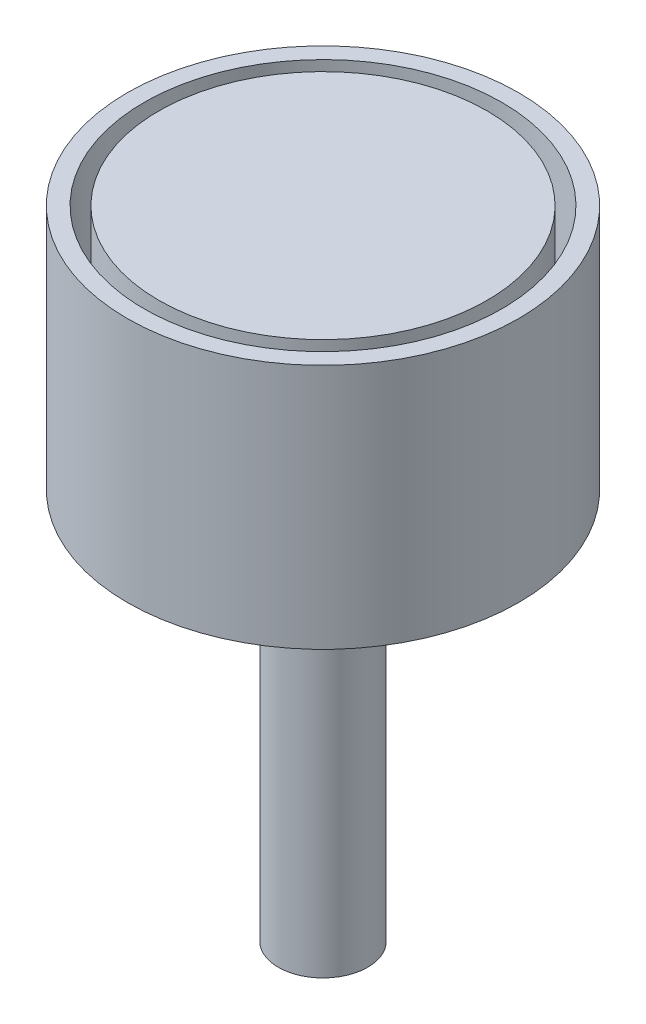
ISO-10303-21;
HEADER;
FILE_DESCRIPTION(('STEP AP214'),'2;1');
FILE_NAME('part.step','',(''),(''),'','','');
FILE_SCHEMA(('AUTOMOTIVE_DESIGN { 1 0 10303 214 1 1 1 1 }'));
ENDSEC;
DATA;
#1=APPLICATION_CONTEXT('core data for automotive mechanical design processes');
#2=APPLICATION_PROTOCOL_DEFINITION('international standard','automotive_design',2000,#1);
#3=PRODUCT_CONTEXT('',#1,'mechanical');
#4=PRODUCT('Part','Part','',(#3));
#5=PRODUCT_RELATED_PRODUCT_CATEGORY('part','',(#4));
#6=PRODUCT_DEFINITION_FORMATION('','',#4);
#7=PRODUCT_DEFINITION_CONTEXT('part definition',#1,'design');
#8=PRODUCT_DEFINITION('design','',#6,#7);
#9=PRODUCT_DEFINITION_SHAPE('','',#8);
#10=(LENGTH_UNIT() NAMED_UNIT(*) SI_UNIT(.MILLI.,.METRE.));
#11=(NAMED_UNIT(*) PLANE_ANGLE_UNIT() SI_UNIT($,.RADIAN.));
#12=(NAMED_UNIT(*) SI_UNIT($,.STERADIAN.) SOLID_ANGLE_UNIT());
#13=UNCERTAINTY_MEASURE_WITH_UNIT(LENGTH_MEASURE(1.E-05),#10,'distance_accuracy_value','');
#14=(GEOMETRIC_REPRESENTATION_CONTEXT(3) GLOBAL_UNCERTAINTY_ASSIGNED_CONTEXT((#13)) GLOBAL_UNIT_ASSIGNED_CONTEXT((#10,
#11,#12)) REPRESENTATION_CONTEXT('',''));
#15=CARTESIAN_POINT('',(0.,0.,0.));
#16=DIRECTION('',(0.,0.,1.));
#17=DIRECTION('',(1.,0.,0.));
#18=AXIS2_PLACEMENT_3D('',#15,#16,#17);
#19=CARTESIAN_POINT('',(0.,0.,0.));
#20=DIRECTION('',(0.,-1.,0.));
#21=DIRECTION('',(0.,0.,-1.));
#22=AXIS2_PLACEMENT_3D('',#19,#20,#21);
#23=PLANE('',#22);
#24=CARTESIAN_POINT('',(0.,0.,0.));
#25=DIRECTION('',(0.,1.,0.));
#26=DIRECTION('',(0.,0.,1.));
#27=AXIS2_PLACEMENT_3D('',#24,#25,#26);
#28=CIRCLE('',#27,14.68);
#29=CARTESIAN_POINT('',(0.,0.,14.68));
#30=VERTEX_POINT('',#29);
#31=EDGE_CURVE('E10',#30,#30,#28,.T.);
#32=ORIENTED_EDGE('',*,*,#31,.T.);
#33=EDGE_LOOP('',(#32));
#34=FACE_BOUND('',#33,.T.);
#35=ADVANCED_FACE('F16',(#34),#23,.F.);
#36=CARTESIAN_POINT('',(0.,-20.002,0.));
#37=DIRECTION('',(0.,1.,0.));
#38=DIRECTION('',(0.,0.,1.));
#39=AXIS2_PLACEMENT_3D('',#36,#37,#38);
#40=CYLINDRICAL_SURFACE('',#39,14.68);
#41=CARTESIAN_POINT('',(0.,-20.,0.));
#42=DIRECTION('',(0.,1.,0.));
#43=DIRECTION('',(0.,0.,-1.));
#44=AXIS2_PLACEMENT_3D('',#41,#42,#43);
#45=CIRCLE('',#44,14.68);
#46=CARTESIAN_POINT('',(0.,-20.,-14.68));
#47=VERTEX_POINT('',#46);
#48=EDGE_CURVE('E94',#47,#47,#45,.T.);
#49=ORIENTED_EDGE('',*,*,#48,.T.);
#50=EDGE_LOOP('',(#49));
#51=FACE_BOUND('',#50,.T.);
#52=ORIENTED_EDGE('',*,*,#31,.F.);
#53=EDGE_LOOP('',(#52));
#54=FACE_BOUND('',#53,.T.);
#55=ADVANCED_FACE('F18',(#51,#54),#40,.T.);
#56=CARTESIAN_POINT('',(0.,-29.1,0.));
#57=DIRECTION('',(0.,-1.,0.));
#58=DIRECTION('',(0.,0.,-1.));
#59=AXIS2_PLACEMENT_3D('',#56,#57,#58);
#60=TOROIDAL_SURFACE('',#59,6.,2.);
#61=CARTESIAN_POINT('',(0.,-29.1,0.));
#62=DIRECTION('',(0.,-1.,0.));
#63=DIRECTION('',(0.,0.,-1.));
#64=AXIS2_PLACEMENT_3D('',#61,#62,#63);
#65=CIRCLE('',#64,4.);
#66=CARTESIAN_POINT('',(0.,-29.1,-4.));
#67=VERTEX_POINT('',#66);
#68=EDGE_CURVE('E98',#67,#67,#65,.T.);
#69=ORIENTED_EDGE('',*,*,#68,.F.);
#70=EDGE_LOOP('',(#69));
#71=FACE_BOUND('',#70,.T.);
#72=CARTESIAN_POINT('',(0.,-27.3679491924311,0.));
#73=DIRECTION('',(0.,1.,0.));
#74=DIRECTION('',(0.,0.,-1.));
#75=AXIS2_PLACEMENT_3D('',#72,#73,#74);
#76=CIRCLE('',#75,5.);
#77=CARTESIAN_POINT('',(0.,-27.3679491924311,-5.));
#78=VERTEX_POINT('',#77);
#79=EDGE_CURVE('E104',#78,#78,#76,.T.);
#80=ORIENTED_EDGE('',*,*,#79,.F.);
#81=EDGE_LOOP('',(#80));
#82=FACE_BOUND('',#81,.T.);
#83=ADVANCED_FACE('F116',(#71,#82),#60,.F.);
#84=CARTESIAN_POINT('',(0.,-57.,0.));
#85=DIRECTION('',(0.,-1.,0.));
#86=DIRECTION('',(0.,0.,-1.));
#87=AXIS2_PLACEMENT_3D('',#84,#85,#86);
#88=PLANE('',#87);
#89=CARTESIAN_POINT('',(0.,-57.,0.));
#90=DIRECTION('',(0.,-1.,0.));
#91=DIRECTION('',(0.,0.,-1.));
#92=AXIS2_PLACEMENT_3D('',#89,#90,#91);
#93=CIRCLE('',#92,4.);
#94=CARTESIAN_POINT('',(0.,-57.,-4.));
#95=VERTEX_POINT('',#94);
#96=EDGE_CURVE('E20',#95,#95,#93,.T.);
#97=ORIENTED_EDGE('',*,*,#96,.T.);
#98=EDGE_LOOP('',(#97));
#99=FACE_BOUND('',#98,.T.);
#100=ADVANCED_FACE('F118',(#99),#88,.T.);
#101=CARTESIAN_POINT('',(0.,-57.,0.));
#102=DIRECTION('',(0.,1.,0.));
#103=DIRECTION('',(0.,0.,1.));
#104=AXIS2_PLACEMENT_3D('',#101,#102,#103);
#105=CYLINDRICAL_SURFACE('',#104,4.);
#106=ORIENTED_EDGE('',*,*,#96,.F.);
#107=EDGE_LOOP('',(#106));
#108=FACE_BOUND('',#107,.T.);
#109=ORIENTED_EDGE('',*,*,#68,.T.);
#110=EDGE_LOOP('',(#109));
#111=FACE_BOUND('',#110,.T.);
#112=ADVANCED_FACE('F126',(#108,#111),#105,.T.);
#113=CARTESIAN_POINT('',(0.,-24.,0.));
#114=DIRECTION('',(0.,-1.,0.));
#115=DIRECTION('',(0.,0.,-1.));
#116=AXIS2_PLACEMENT_3D('',#113,#114,#115);
#117=TOROIDAL_SURFACE('',#116,7.,2.);
#118=CARTESIAN_POINT('',(0.,-22.,0.));
#119=DIRECTION('',(0.,1.,0.));
#120=DIRECTION('',(0.,0.,-1.));
#121=AXIS2_PLACEMENT_3D('',#118,#119,#120);
#122=CIRCLE('',#121,7.);
#123=CARTESIAN_POINT('',(0.,-22.,-7.));
#124=VERTEX_POINT('',#123);
#125=EDGE_CURVE('E107',#124,#124,#122,.T.);
#126=ORIENTED_EDGE('',*,*,#125,.F.);
#127=EDGE_LOOP('',(#126));
#128=FACE_BOUND('',#127,.T.);
#129=CARTESIAN_POINT('',(0.,-24.,0.));
#130=DIRECTION('',(0.,-1.,0.));
#131=DIRECTION('',(0.,0.,-1.));
#132=AXIS2_PLACEMENT_3D('',#129,#130,#131);
#133=CIRCLE('',#132,5.);
#134=CARTESIAN_POINT('',(0.,-24.,-5.));
#135=VERTEX_POINT('',#134);
#136=EDGE_CURVE('E101',#135,#135,#133,.T.);
#137=ORIENTED_EDGE('',*,*,#136,.F.);
#138=EDGE_LOOP('',(#137));
#139=FACE_BOUND('',#138,.T.);
#140=ADVANCED_FACE('F166',(#128,#139),#117,.F.);
#141=CARTESIAN_POINT('',(0.,-27.1,0.));
#142=DIRECTION('',(0.,1.,0.));
#143=DIRECTION('',(0.,0.,1.));
#144=AXIS2_PLACEMENT_3D('',#141,#142,#143);
#145=CYLINDRICAL_SURFACE('',#144,5.);
#146=ORIENTED_EDGE('',*,*,#136,.T.);
#147=EDGE_LOOP('',(#146));
#148=FACE_BOUND('',#147,.T.);
#149=ORIENTED_EDGE('',*,*,#79,.T.);
#150=EDGE_LOOP('',(#149));
#151=FACE_BOUND('',#150,.T.);
#152=ADVANCED_FACE('F114',(#148,#151),#145,.T.);
#153=CARTESIAN_POINT('',(0.,-22.,0.));
#154=DIRECTION('',(0.,-1.,0.));
#155=DIRECTION('',(0.,0.,-1.));
#156=AXIS2_PLACEMENT_3D('',#153,#154,#155);
#157=PLANE('',#156);
#158=CARTESIAN_POINT('',(0.,-22.,0.));
#159=DIRECTION('',(0.,-1.,0.));
#160=DIRECTION('',(0.,0.,-1.));
#161=AXIS2_PLACEMENT_3D('',#158,#159,#160);
#162=CIRCLE('',#161,17.5);
#163=CARTESIAN_POINT('',(0.,-22.,-17.5));
#164=VERTEX_POINT('',#163);
#165=EDGE_CURVE('E92',#164,#164,#162,.T.);
#166=ORIENTED_EDGE('',*,*,#165,.T.);
#167=EDGE_LOOP('',(#166));
#168=FACE_BOUND('',#167,.T.);
#169=ORIENTED_EDGE('',*,*,#125,.T.);
#170=EDGE_LOOP('',(#169));
#171=FACE_BOUND('',#170,.T.);
#172=ADVANCED_FACE('F188',(#168,#171),#157,.T.);
#173=CARTESIAN_POINT('',(0.,-20.,0.));
#174=DIRECTION('',(0.,-1.,0.));
#175=DIRECTION('',(0.,0.,-1.));
#176=AXIS2_PLACEMENT_3D('',#173,#174,#175);
#177=PLANE('',#176);
#178=CARTESIAN_POINT('',(0.,-20.,0.));
#179=DIRECTION('',(0.,-1.,0.));
#180=DIRECTION('',(0.,0.,-1.));
#181=AXIS2_PLACEMENT_3D('',#178,#179,#180);
#182=CIRCLE('',#181,16.);
#183=CARTESIAN_POINT('',(0.,-20.,-16.));
#184=VERTEX_POINT('',#183);
#185=EDGE_CURVE('E79',#184,#184,#182,.T.);
#186=ORIENTED_EDGE('',*,*,#185,.F.);
#187=EDGE_LOOP('',(#186));
#188=FACE_BOUND('',#187,.T.);
#189=ORIENTED_EDGE('',*,*,#48,.F.);
#190=EDGE_LOOP('',(#189));
#191=FACE_BOUND('',#190,.T.);
#192=ADVANCED_FACE('F200',(#188,#191),#177,.F.);
#193=CARTESIAN_POINT('',(0.,0.,0.));
#194=DIRECTION('',(0.,-1.,0.));
#195=DIRECTION('',(0.,0.,-1.));
#196=AXIS2_PLACEMENT_3D('',#193,#194,#195);
#197=PLANE('',#196);
#198=CARTESIAN_POINT('',(0.,0.,0.));
#199=DIRECTION('',(0.,-1.,0.));
#200=DIRECTION('',(0.,0.,-1.));
#201=AXIS2_PLACEMENT_3D('',#198,#199,#200);
#202=CIRCLE('',#201,17.5);
#203=CARTESIAN_POINT('',(0.,0.,-17.5));
#204=VERTEX_POINT('',#203);
#205=EDGE_CURVE('E89',#204,#204,#202,.T.);
#206=ORIENTED_EDGE('',*,*,#205,.F.);
#207=EDGE_LOOP('',(#206));
#208=FACE_BOUND('',#207,.T.);
#209=CARTESIAN_POINT('',(0.,0.,0.));
#210=DIRECTION('',(0.,-1.,0.));
#211=DIRECTION('',(0.,0.,-1.));
#212=AXIS2_PLACEMENT_3D('',#209,#210,#211);
#213=CIRCLE('',#212,16.);
#214=CARTESIAN_POINT('',(0.,0.,-16.));
#215=VERTEX_POINT('',#214);
#216=EDGE_CURVE('E83',#215,#215,#213,.T.);
#217=ORIENTED_EDGE('',*,*,#216,.T.);
#218=EDGE_LOOP('',(#217));
#219=FACE_BOUND('',#218,.T.);
#220=ADVANCED_FACE('F211',(#208,#219),#197,.F.);
#221=CARTESIAN_POINT('',(0.,-20.,0.));
#222=DIRECTION('',(0.,1.,0.));
#223=DIRECTION('',(0.,0.,1.));
#224=AXIS2_PLACEMENT_3D('',#221,#222,#223);
#225=CYLINDRICAL_SURFACE('',#224,17.5);
#226=ORIENTED_EDGE('',*,*,#165,.F.);
#227=EDGE_LOOP('',(#226));
#228=FACE_BOUND('',#227,.T.);
#229=ORIENTED_EDGE('',*,*,#205,.T.);
#230=EDGE_LOOP('',(#229));
#231=FACE_BOUND('',#230,.T.);
#232=ADVANCED_FACE('F220',(#228,#231),#225,.T.);
#233=CARTESIAN_POINT('',(0.,-20.,0.));
#234=DIRECTION('',(0.,1.,0.));
#235=DIRECTION('',(0.,0.,1.));
#236=AXIS2_PLACEMENT_3D('',#233,#234,#235);
#237=CYLINDRICAL_SURFACE('',#236,16.);
#238=ORIENTED_EDGE('',*,*,#216,.F.);
#239=EDGE_LOOP('',(#238));
#240=FACE_BOUND('',#239,.T.);
#241=ORIENTED_EDGE('',*,*,#185,.T.);
#242=EDGE_LOOP('',(#241));
#243=FACE_BOUND('',#242,.T.);
#244=ADVANCED_FACE('F80',(#240,#243),#237,.F.);
#245=CLOSED_SHELL('',(#35,#55,#83,#100,#112,#140,#152,#172,#192,#220,#232,#244));
#246=MANIFOLD_SOLID_BREP('B1',#245);
#247=ADVANCED_BREP_SHAPE_REPRESENTATION('',(#18,#246),#14);
#248=SHAPE_DEFINITION_REPRESENTATION(#9,#247);
ENDSEC;
END-ISO-10303-21;
